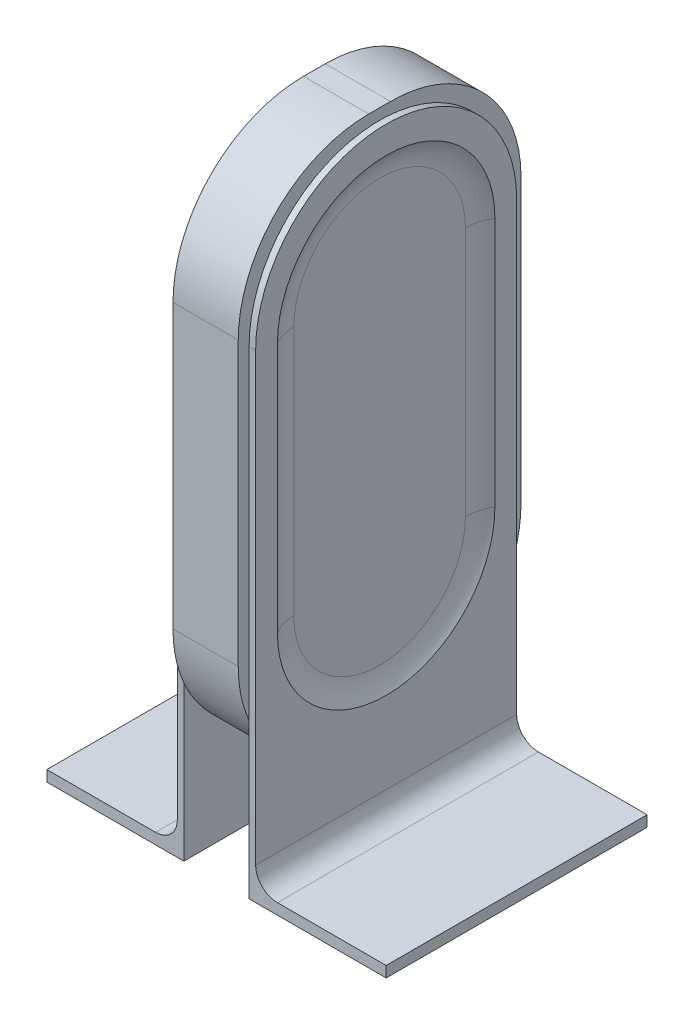
ISO-10303-21;
HEADER;
FILE_DESCRIPTION(('STEP AP214'),'2;1');
FILE_NAME('part.step','',(''),(''),'','','');
FILE_SCHEMA(('AUTOMOTIVE_DESIGN { 1 0 10303 214 1 1 1 1 }'));
ENDSEC;
DATA;
#1=APPLICATION_CONTEXT('core data for automotive mechanical design processes');
#2=APPLICATION_PROTOCOL_DEFINITION('international standard','automotive_design',2000,#1);
#3=PRODUCT_CONTEXT('',#1,'mechanical');
#4=PRODUCT('Part','Part','',(#3));
#5=PRODUCT_RELATED_PRODUCT_CATEGORY('part','',(#4));
#6=PRODUCT_DEFINITION_FORMATION('','',#4);
#7=PRODUCT_DEFINITION_CONTEXT('part definition',#1,'design');
#8=PRODUCT_DEFINITION('design','',#6,#7);
#9=PRODUCT_DEFINITION_SHAPE('','',#8);
#10=(LENGTH_UNIT() NAMED_UNIT(*) SI_UNIT(.MILLI.,.METRE.));
#11=(NAMED_UNIT(*) PLANE_ANGLE_UNIT() SI_UNIT($,.RADIAN.));
#12=(NAMED_UNIT(*) SI_UNIT($,.STERADIAN.) SOLID_ANGLE_UNIT());
#13=UNCERTAINTY_MEASURE_WITH_UNIT(LENGTH_MEASURE(1.E-05),#10,'distance_accuracy_value','');
#14=(GEOMETRIC_REPRESENTATION_CONTEXT(3) GLOBAL_UNCERTAINTY_ASSIGNED_CONTEXT((#13)) GLOBAL_UNIT_ASSIGNED_CONTEXT((#10,
#11,#12)) REPRESENTATION_CONTEXT('',''));
#15=CARTESIAN_POINT('',(0.,0.,0.));
#16=DIRECTION('',(0.,0.,1.));
#17=DIRECTION('',(1.,0.,0.));
#18=AXIS2_PLACEMENT_3D('',#15,#16,#17);
#19=CARTESIAN_POINT('',(18.,60.,0.));
#20=DIRECTION('',(1.,0.,0.));
#21=DIRECTION('',(0.,0.,-1.));
#22=AXIS2_PLACEMENT_3D('',#19,#20,#21);
#23=PLANE('',#22);
#24=DIRECTION('',(0.,1.,0.));
#25=VECTOR('',#24,1.);
#26=CARTESIAN_POINT('',(18.,-57.5,-50.));
#27=LINE('',#26,#25);
#28=CARTESIAN_POINT('',(18.,-57.5,-50.));
#29=VERTEX_POINT('',#28);
#30=CARTESIAN_POINT('',(18.,57.5,-50.));
#31=VERTEX_POINT('',#30);
#32=EDGE_CURVE('E383',#29,#31,#27,.T.);
#33=ORIENTED_EDGE('',*,*,#32,.F.);
#34=CARTESIAN_POINT('',(18.,-57.5,0.));
#35=DIRECTION('',(1.,0.,0.));
#36=DIRECTION('',(0.,0.,-1.));
#37=AXIS2_PLACEMENT_3D('',#34,#35,#36);
#38=CIRCLE('',#37,50.);
#39=CARTESIAN_POINT('',(18.,-57.5000000000001,50.));
#40=VERTEX_POINT('',#39);
#41=EDGE_CURVE('E379',#40,#29,#38,.T.);
#42=ORIENTED_EDGE('',*,*,#41,.F.);
#43=DIRECTION('',(0.,-1.,0.));
#44=VECTOR('',#43,1.);
#45=CARTESIAN_POINT('',(18.,-57.5000000000001,50.));
#46=LINE('',#45,#44);
#47=CARTESIAN_POINT('',(18.,57.5,50.));
#48=VERTEX_POINT('',#47);
#49=EDGE_CURVE('E392',#48,#40,#46,.T.);
#50=ORIENTED_EDGE('',*,*,#49,.F.);
#51=CARTESIAN_POINT('',(18.,57.5,0.));
#52=DIRECTION('',(1.,0.,0.));
#53=DIRECTION('',(0.,0.,-1.));
#54=AXIS2_PLACEMENT_3D('',#51,#52,#53);
#55=CIRCLE('',#54,50.);
#56=EDGE_CURVE('E388',#31,#48,#55,.T.);
#57=ORIENTED_EDGE('',*,*,#56,.F.);
#58=EDGE_LOOP('',(#33,#42,#50,#57));
#59=FACE_BOUND('',#58,.T.);
#60=DIRECTION('',(0.,-1.,0.));
#61=VECTOR('',#60,1.);
#62=CARTESIAN_POINT('',(18.,-60.,60.));
#63=LINE('',#62,#61);
#64=CARTESIAN_POINT('',(18.,60.,60.));
#65=VERTEX_POINT('',#64);
#66=CARTESIAN_POINT('',(18.,-145.,60.));
#67=VERTEX_POINT('',#66);
#68=EDGE_CURVE('E397',#65,#67,#63,.T.);
#69=ORIENTED_EDGE('',*,*,#68,.T.);
#70=DIRECTION('',(0.,0.,-1.));
#71=VECTOR('',#70,1.);
#72=CARTESIAN_POINT('',(18.,-145.,0.));
#73=LINE('',#72,#71);
#74=CARTESIAN_POINT('',(18.,-145.,-60.0000000000001));
#75=VERTEX_POINT('',#74);
#76=EDGE_CURVE('E571',#67,#75,#73,.T.);
#77=ORIENTED_EDGE('',*,*,#76,.T.);
#78=DIRECTION('',(0.,1.,0.));
#79=VECTOR('',#78,1.);
#80=CARTESIAN_POINT('',(18.,-160.,-60.0000000000001));
#81=LINE('',#80,#79);
#82=CARTESIAN_POINT('',(18.,60.,-60.));
#83=VERTEX_POINT('',#82);
#84=EDGE_CURVE('E401',#75,#83,#81,.T.);
#85=ORIENTED_EDGE('',*,*,#84,.T.);
#86=CARTESIAN_POINT('',(18.,60.,0.));
#87=DIRECTION('',(1.,0.,0.));
#88=DIRECTION('',(0.,0.,-1.));
#89=AXIS2_PLACEMENT_3D('',#86,#87,#88);
#90=CIRCLE('',#89,60.);
#91=EDGE_CURVE('E405',#83,#65,#90,.T.);
#92=ORIENTED_EDGE('',*,*,#91,.T.);
#93=EDGE_LOOP('',(#69,#77,#85,#92));
#94=FACE_BOUND('',#93,.T.);
#95=ADVANCED_FACE('F45',(#59,#94),#23,.T.);
#96=CARTESIAN_POINT('',(15.,65.,5.00000000000002));
#97=DIRECTION('',(-1.,0.,0.));
#98=DIRECTION('',(0.,0.,1.));
#99=AXIS2_PLACEMENT_3D('',#96,#97,#98);
#100=CYLINDRICAL_SURFACE('',#99,60.);
#101=CARTESIAN_POINT('',(-15.,65.,5.00000000000002));
#102=DIRECTION('',(1.,0.,0.));
#103=DIRECTION('',(0.,0.,-1.));
#104=AXIS2_PLACEMENT_3D('',#101,#102,#103);
#105=CIRCLE('',#104,60.);
#106=CARTESIAN_POINT('',(-15.,125.,5.00000000000002));
#107=VERTEX_POINT('',#106);
#108=CARTESIAN_POINT('',(-15.,65.,65.));
#109=VERTEX_POINT('',#108);
#110=EDGE_CURVE('E441',#107,#109,#105,.T.);
#111=ORIENTED_EDGE('',*,*,#110,.T.);
#112=DIRECTION('',(-1.,0.,0.));
#113=VECTOR('',#112,1.);
#114=CARTESIAN_POINT('',(15.,65.,65.));
#115=LINE('',#114,#113);
#116=CARTESIAN_POINT('',(15.,65.,65.));
#117=VERTEX_POINT('',#116);
#118=EDGE_CURVE('E529',#117,#109,#115,.T.);
#119=ORIENTED_EDGE('',*,*,#118,.F.);
#120=CARTESIAN_POINT('',(15.,65.,5.00000000000002));
#121=DIRECTION('',(1.,0.,0.));
#122=DIRECTION('',(0.,0.,-1.));
#123=AXIS2_PLACEMENT_3D('',#120,#121,#122);
#124=CIRCLE('',#123,60.);
#125=CARTESIAN_POINT('',(15.,125.,5.00000000000002));
#126=VERTEX_POINT('',#125);
#127=EDGE_CURVE('E442',#126,#117,#124,.T.);
#128=ORIENTED_EDGE('',*,*,#127,.F.);
#129=DIRECTION('',(-1.,0.,0.));
#130=VECTOR('',#129,1.);
#131=CARTESIAN_POINT('',(15.,125.,5.00000000000002));
#132=LINE('',#131,#130);
#133=EDGE_CURVE('E473',#126,#107,#132,.T.);
#134=ORIENTED_EDGE('',*,*,#133,.T.);
#135=EDGE_LOOP('',(#111,#119,#128,#134));
#136=FACE_BOUND('',#135,.T.);
#137=ADVANCED_FACE('F652',(#136),#100,.T.);
#138=CARTESIAN_POINT('',(15.,65.,65.));
#139=DIRECTION('',(0.,0.,-1.));
#140=DIRECTION('',(-1.,0.,0.));
#141=AXIS2_PLACEMENT_3D('',#138,#139,#140);
#142=PLANE('',#141);
#143=DIRECTION('',(0.,-1.,0.));
#144=VECTOR('',#143,1.);
#145=CARTESIAN_POINT('',(-15.,65.,65.));
#146=LINE('',#145,#144);
#147=CARTESIAN_POINT('',(-15.,-65.,65.));
#148=VERTEX_POINT('',#147);
#149=EDGE_CURVE('E477',#109,#148,#146,.T.);
#150=ORIENTED_EDGE('',*,*,#149,.T.);
#151=DIRECTION('',(-1.,0.,0.));
#152=VECTOR('',#151,1.);
#153=CARTESIAN_POINT('',(15.,-65.,65.));
#154=LINE('',#153,#152);
#155=CARTESIAN_POINT('',(15.,-65.,65.));
#156=VERTEX_POINT('',#155);
#157=EDGE_CURVE('E525',#156,#148,#154,.T.);
#158=ORIENTED_EDGE('',*,*,#157,.F.);
#159=DIRECTION('',(0.,-1.,0.));
#160=VECTOR('',#159,1.);
#161=CARTESIAN_POINT('',(15.,65.,65.));
#162=LINE('',#161,#160);
#163=EDGE_CURVE('E446',#117,#156,#162,.T.);
#164=ORIENTED_EDGE('',*,*,#163,.F.);
#165=ORIENTED_EDGE('',*,*,#118,.T.);
#166=EDGE_LOOP('',(#150,#158,#164,#165));
#167=FACE_BOUND('',#166,.T.);
#168=ADVANCED_FACE('F647',(#167),#142,.F.);
#169=CARTESIAN_POINT('',(15.,-65.,5.));
#170=DIRECTION('',(-1.,0.,0.));
#171=DIRECTION('',(0.,0.,1.));
#172=AXIS2_PLACEMENT_3D('',#169,#170,#171);
#173=CYLINDRICAL_SURFACE('',#172,60.);
#174=CARTESIAN_POINT('',(-15.,-65.,5.));
#175=DIRECTION('',(1.,0.,0.));
#176=DIRECTION('',(0.,0.,1.));
#177=AXIS2_PLACEMENT_3D('',#174,#175,#176);
#178=CIRCLE('',#177,60.);
#179=CARTESIAN_POINT('',(-15.,-88.9791576165636,60.));
#180=VERTEX_POINT('',#179);
#181=EDGE_CURVE('E481',#148,#180,#178,.T.);
#182=ORIENTED_EDGE('',*,*,#181,.T.);
#183=CARTESIAN_POINT('',(-15.,-125.,5.));
#184=VERTEX_POINT('',#183);
#185=EDGE_CURVE('E480',#180,#184,#178,.T.);
#186=ORIENTED_EDGE('',*,*,#185,.T.);
#187=DIRECTION('',(-1.,0.,0.));
#188=VECTOR('',#187,1.);
#189=CARTESIAN_POINT('',(15.,-125.,5.));
#190=LINE('',#189,#188);
#191=CARTESIAN_POINT('',(15.,-125.,5.));
#192=VERTEX_POINT('',#191);
#193=EDGE_CURVE('E521',#192,#184,#190,.T.);
#194=ORIENTED_EDGE('',*,*,#193,.F.);
#195=CARTESIAN_POINT('',(15.,-65.,5.));
#196=DIRECTION('',(1.,0.,0.));
#197=DIRECTION('',(0.,0.,1.));
#198=AXIS2_PLACEMENT_3D('',#195,#196,#197);
#199=CIRCLE('',#198,60.);
#200=CARTESIAN_POINT('',(15.,-88.9791576165635,60.));
#201=VERTEX_POINT('',#200);
#202=EDGE_CURVE('E450',#201,#192,#199,.T.);
#203=ORIENTED_EDGE('',*,*,#202,.F.);
#204=EDGE_CURVE('E451',#156,#201,#199,.T.);
#205=ORIENTED_EDGE('',*,*,#204,.F.);
#206=ORIENTED_EDGE('',*,*,#157,.T.);
#207=EDGE_LOOP('',(#182,#186,#194,#203,#205,#206));
#208=FACE_BOUND('',#207,.T.);
#209=ADVANCED_FACE('F640',(#208),#173,.T.);
#210=CARTESIAN_POINT('',(15.,-125.,-5.00000000000001));
#211=DIRECTION('',(0.,1.,0.));
#212=DIRECTION('',(0.,0.,1.));
#213=AXIS2_PLACEMENT_3D('',#210,#211,#212);
#214=PLANE('',#213);
#215=DIRECTION('',(0.,0.,-1.));
#216=VECTOR('',#215,1.);
#217=CARTESIAN_POINT('',(-15.,-125.,-5.00000000000001));
#218=LINE('',#217,#216);
#219=CARTESIAN_POINT('',(-15.,-125.,-5.00000000000002));
#220=VERTEX_POINT('',#219);
#221=EDGE_CURVE('E485',#184,#220,#218,.T.);
#222=ORIENTED_EDGE('',*,*,#221,.T.);
#223=DIRECTION('',(-1.,0.,0.));
#224=VECTOR('',#223,1.);
#225=CARTESIAN_POINT('',(15.,-125.,-5.00000000000002));
#226=LINE('',#225,#224);
#227=CARTESIAN_POINT('',(15.,-125.,-5.00000000000002));
#228=VERTEX_POINT('',#227);
#229=EDGE_CURVE('E517',#228,#220,#226,.T.);
#230=ORIENTED_EDGE('',*,*,#229,.F.);
#231=DIRECTION('',(0.,0.,-1.));
#232=VECTOR('',#231,1.);
#233=CARTESIAN_POINT('',(15.,-125.,-5.00000000000001));
#234=LINE('',#233,#232);
#235=EDGE_CURVE('E455',#192,#228,#234,.T.);
#236=ORIENTED_EDGE('',*,*,#235,.F.);
#237=ORIENTED_EDGE('',*,*,#193,.T.);
#238=EDGE_LOOP('',(#222,#230,#236,#237));
#239=FACE_BOUND('',#238,.T.);
#240=ADVANCED_FACE('F628',(#239),#214,.F.);
#241=CARTESIAN_POINT('',(15.,-65.,-5.00000000000001));
#242=DIRECTION('',(-1.,0.,0.));
#243=DIRECTION('',(0.,0.,1.));
#244=AXIS2_PLACEMENT_3D('',#241,#242,#243);
#245=CYLINDRICAL_SURFACE('',#244,60.);
#246=CARTESIAN_POINT('',(-15.,-65.,-5.00000000000001));
#247=DIRECTION('',(1.,0.,0.));
#248=DIRECTION('',(0.,0.,1.));
#249=AXIS2_PLACEMENT_3D('',#246,#247,#248);
#250=CIRCLE('',#249,60.);
#251=CARTESIAN_POINT('',(-15.,-88.9791576165637,-60.));
#252=VERTEX_POINT('',#251);
#253=EDGE_CURVE('E490',#220,#252,#250,.T.);
#254=ORIENTED_EDGE('',*,*,#253,.T.);
#255=CARTESIAN_POINT('',(-15.,-65.,-65.));
#256=VERTEX_POINT('',#255);
#257=EDGE_CURVE('E489',#252,#256,#250,.T.);
#258=ORIENTED_EDGE('',*,*,#257,.T.);
#259=DIRECTION('',(-1.,0.,0.));
#260=VECTOR('',#259,1.);
#261=CARTESIAN_POINT('',(15.,-65.,-65.));
#262=LINE('',#261,#260);
#263=CARTESIAN_POINT('',(15.,-65.,-65.));
#264=VERTEX_POINT('',#263);
#265=EDGE_CURVE('E513',#264,#256,#262,.T.);
#266=ORIENTED_EDGE('',*,*,#265,.F.);
#267=CARTESIAN_POINT('',(15.,-65.,-5.00000000000001));
#268=DIRECTION('',(1.,0.,0.));
#269=DIRECTION('',(0.,0.,1.));
#270=AXIS2_PLACEMENT_3D('',#267,#268,#269);
#271=CIRCLE('',#270,60.);
#272=CARTESIAN_POINT('',(15.,-88.9791576165637,-60.));
#273=VERTEX_POINT('',#272);
#274=EDGE_CURVE('E459',#273,#264,#271,.T.);
#275=ORIENTED_EDGE('',*,*,#274,.F.);
#276=EDGE_CURVE('E460',#228,#273,#271,.T.);
#277=ORIENTED_EDGE('',*,*,#276,.F.);
#278=ORIENTED_EDGE('',*,*,#229,.T.);
#279=EDGE_LOOP('',(#254,#258,#266,#275,#277,#278));
#280=FACE_BOUND('',#279,.T.);
#281=ADVANCED_FACE('F631',(#280),#245,.T.);
#282=CARTESIAN_POINT('',(15.,65.,-65.));
#283=DIRECTION('',(0.,0.,1.));
#284=DIRECTION('',(0.,-1.,0.));
#285=AXIS2_PLACEMENT_3D('',#282,#283,#284);
#286=PLANE('',#285);
#287=DIRECTION('',(0.,1.,0.));
#288=VECTOR('',#287,1.);
#289=CARTESIAN_POINT('',(-15.,65.,-65.));
#290=LINE('',#289,#288);
#291=CARTESIAN_POINT('',(-15.,65.,-65.));
#292=VERTEX_POINT('',#291);
#293=EDGE_CURVE('E494',#256,#292,#290,.T.);
#294=ORIENTED_EDGE('',*,*,#293,.T.);
#295=DIRECTION('',(-1.,0.,0.));
#296=VECTOR('',#295,1.);
#297=CARTESIAN_POINT('',(15.,65.,-65.));
#298=LINE('',#297,#296);
#299=CARTESIAN_POINT('',(15.,65.,-65.));
#300=VERTEX_POINT('',#299);
#301=EDGE_CURVE('E509',#300,#292,#298,.T.);
#302=ORIENTED_EDGE('',*,*,#301,.F.);
#303=DIRECTION('',(0.,1.,0.));
#304=VECTOR('',#303,1.);
#305=CARTESIAN_POINT('',(15.,65.,-65.));
#306=LINE('',#305,#304);
#307=EDGE_CURVE('E464',#264,#300,#306,.T.);
#308=ORIENTED_EDGE('',*,*,#307,.F.);
#309=ORIENTED_EDGE('',*,*,#265,.T.);
#310=EDGE_LOOP('',(#294,#302,#308,#309));
#311=FACE_BOUND('',#310,.T.);
#312=ADVANCED_FACE('F665',(#311),#286,.F.);
#313=CARTESIAN_POINT('',(15.,65.,-4.99999999999999));
#314=DIRECTION('',(-1.,0.,0.));
#315=DIRECTION('',(0.,0.,1.));
#316=AXIS2_PLACEMENT_3D('',#313,#314,#315);
#317=CYLINDRICAL_SURFACE('',#316,60.);
#318=CARTESIAN_POINT('',(-15.,65.,-4.99999999999999));
#319=DIRECTION('',(1.,0.,0.));
#320=DIRECTION('',(0.,0.,1.));
#321=AXIS2_PLACEMENT_3D('',#318,#319,#320);
#322=CIRCLE('',#321,60.);
#323=CARTESIAN_POINT('',(-15.,125.,-4.99999999999998));
#324=VERTEX_POINT('',#323);
#325=EDGE_CURVE('E497',#292,#324,#322,.T.);
#326=ORIENTED_EDGE('',*,*,#325,.T.);
#327=DIRECTION('',(-1.,0.,0.));
#328=VECTOR('',#327,1.);
#329=CARTESIAN_POINT('',(15.,125.,-4.99999999999998));
#330=LINE('',#329,#328);
#331=CARTESIAN_POINT('',(15.,125.,-4.99999999999998));
#332=VERTEX_POINT('',#331);
#333=EDGE_CURVE('E505',#332,#324,#330,.T.);
#334=ORIENTED_EDGE('',*,*,#333,.F.);
#335=CARTESIAN_POINT('',(15.,65.,-4.99999999999999));
#336=DIRECTION('',(1.,0.,0.));
#337=DIRECTION('',(0.,0.,1.));
#338=AXIS2_PLACEMENT_3D('',#335,#336,#337);
#339=CIRCLE('',#338,60.);
#340=EDGE_CURVE('E467',#300,#332,#339,.T.);
#341=ORIENTED_EDGE('',*,*,#340,.F.);
#342=ORIENTED_EDGE('',*,*,#301,.T.);
#343=EDGE_LOOP('',(#326,#334,#341,#342));
#344=FACE_BOUND('',#343,.T.);
#345=ADVANCED_FACE('F660',(#344),#317,.T.);
#346=CARTESIAN_POINT('',(15.,125.,-4.99999999999998));
#347=DIRECTION('',(0.,-1.,0.));
#348=DIRECTION('',(0.,0.,-1.));
#349=AXIS2_PLACEMENT_3D('',#346,#347,#348);
#350=PLANE('',#349);
#351=DIRECTION('',(0.,0.,1.));
#352=VECTOR('',#351,1.);
#353=CARTESIAN_POINT('',(-15.,125.,-4.99999999999998));
#354=LINE('',#353,#352);
#355=EDGE_CURVE('E447',#324,#107,#354,.T.);
#356=ORIENTED_EDGE('',*,*,#355,.T.);
#357=ORIENTED_EDGE('',*,*,#133,.F.);
#358=DIRECTION('',(0.,0.,1.));
#359=VECTOR('',#358,1.);
#360=CARTESIAN_POINT('',(15.,125.,-4.99999999999998));
#361=LINE('',#360,#359);
#362=EDGE_CURVE('E470',#332,#126,#361,.T.);
#363=ORIENTED_EDGE('',*,*,#362,.F.);
#364=ORIENTED_EDGE('',*,*,#333,.T.);
#365=EDGE_LOOP('',(#356,#357,#363,#364));
#366=FACE_BOUND('',#365,.T.);
#367=ADVANCED_FACE('F656',(#366),#350,.F.);
#368=CARTESIAN_POINT('',(15.,65.,5.00000000000002));
#369=DIRECTION('',(1.,0.,0.));
#370=DIRECTION('',(0.,0.,-1.));
#371=AXIS2_PLACEMENT_3D('',#368,#369,#370);
#372=PLANE('',#371);
#373=DIRECTION('',(0.,-1.,0.));
#374=VECTOR('',#373,1.);
#375=CARTESIAN_POINT('',(15.,-60.,60.));
#376=LINE('',#375,#374);
#377=CARTESIAN_POINT('',(15.,60.,60.));
#378=VERTEX_POINT('',#377);
#379=EDGE_CURVE('E402',#378,#201,#376,.T.);
#380=ORIENTED_EDGE('',*,*,#379,.F.);
#381=CARTESIAN_POINT('',(15.,60.,0.));
#382=DIRECTION('',(1.,0.,0.));
#383=DIRECTION('',(0.,0.,-1.));
#384=AXIS2_PLACEMENT_3D('',#381,#382,#383);
#385=CIRCLE('',#384,60.);
#386=CARTESIAN_POINT('',(15.,60.,-60.));
#387=VERTEX_POINT('',#386);
#388=EDGE_CURVE('E417',#387,#378,#385,.T.);
#389=ORIENTED_EDGE('',*,*,#388,.F.);
#390=DIRECTION('',(0.,1.,0.));
#391=VECTOR('',#390,1.);
#392=CARTESIAN_POINT('',(15.,-60.,-60.));
#393=LINE('',#392,#391);
#394=EDGE_CURVE('E418',#273,#387,#393,.T.);
#395=ORIENTED_EDGE('',*,*,#394,.F.);
#396=ORIENTED_EDGE('',*,*,#274,.T.);
#397=ORIENTED_EDGE('',*,*,#307,.T.);
#398=ORIENTED_EDGE('',*,*,#340,.T.);
#399=ORIENTED_EDGE('',*,*,#362,.T.);
#400=ORIENTED_EDGE('',*,*,#127,.T.);
#401=ORIENTED_EDGE('',*,*,#163,.T.);
#402=ORIENTED_EDGE('',*,*,#204,.T.);
#403=EDGE_LOOP('',(#380,#389,#395,#396,#397,#398,#399,#400,#401,#402));
#404=FACE_BOUND('',#403,.T.);
#405=ADVANCED_FACE('F642',(#404),#372,.T.);
#406=CARTESIAN_POINT('',(-15.,65.,5.00000000000002));
#407=DIRECTION('',(1.,0.,0.));
#408=DIRECTION('',(0.,0.,-1.));
#409=AXIS2_PLACEMENT_3D('',#406,#407,#408);
#410=PLANE('',#409);
#411=ORIENTED_EDGE('',*,*,#257,.F.);
#412=DIRECTION('',(0.,1.,0.));
#413=VECTOR('',#412,1.);
#414=CARTESIAN_POINT('',(-15.,65.0000000000001,-59.9999999999998));
#415=LINE('',#414,#413);
#416=CARTESIAN_POINT('',(-15.,60.,-60.));
#417=VERTEX_POINT('',#416);
#418=EDGE_CURVE('E346',#252,#417,#415,.T.);
#419=ORIENTED_EDGE('',*,*,#418,.T.);
#420=CARTESIAN_POINT('',(-15.,60.,0.));
#421=DIRECTION('',(1.,0.,0.));
#422=DIRECTION('',(0.,0.,-1.));
#423=AXIS2_PLACEMENT_3D('',#420,#421,#422);
#424=CIRCLE('',#423,60.);
#425=CARTESIAN_POINT('',(-15.,60.,60.));
#426=VERTEX_POINT('',#425);
#427=EDGE_CURVE('E321',#417,#426,#424,.T.);
#428=ORIENTED_EDGE('',*,*,#427,.T.);
#429=DIRECTION('',(0.,-1.,0.));
#430=VECTOR('',#429,1.);
#431=CARTESIAN_POINT('',(-15.,65.,60.0000000000001));
#432=LINE('',#431,#430);
#433=EDGE_CURVE('E338',#426,#180,#432,.T.);
#434=ORIENTED_EDGE('',*,*,#433,.T.);
#435=ORIENTED_EDGE('',*,*,#181,.F.);
#436=ORIENTED_EDGE('',*,*,#149,.F.);
#437=ORIENTED_EDGE('',*,*,#110,.F.);
#438=ORIENTED_EDGE('',*,*,#355,.F.);
#439=ORIENTED_EDGE('',*,*,#325,.F.);
#440=ORIENTED_EDGE('',*,*,#293,.F.);
#441=EDGE_LOOP('',(#411,#419,#428,#434,#435,#436,#437,#438,#439,#440));
#442=FACE_BOUND('',#441,.T.);
#443=ADVANCED_FACE('F624',(#442),#410,.F.);
#444=CARTESIAN_POINT('',(15.,60.,0.));
#445=DIRECTION('',(1.,0.,0.));
#446=DIRECTION('',(0.,0.,-1.));
#447=AXIS2_PLACEMENT_3D('',#444,#445,#446);
#448=PLANE('',#447);
#449=CARTESIAN_POINT('',(15.,-160.,60.));
#450=VERTEX_POINT('',#449);
#451=EDGE_CURVE('E422',#201,#450,#376,.T.);
#452=ORIENTED_EDGE('',*,*,#451,.F.);
#453=ORIENTED_EDGE('',*,*,#202,.T.);
#454=ORIENTED_EDGE('',*,*,#235,.T.);
#455=ORIENTED_EDGE('',*,*,#276,.T.);
#456=CARTESIAN_POINT('',(15.,-160.,-60.0000000000001));
#457=VERTEX_POINT('',#456);
#458=EDGE_CURVE('E413',#457,#273,#393,.T.);
#459=ORIENTED_EDGE('',*,*,#458,.F.);
#460=DIRECTION('',(0.,0.,-1.));
#461=VECTOR('',#460,1.);
#462=CARTESIAN_POINT('',(15.,-160.,60.));
#463=LINE('',#462,#461);
#464=EDGE_CURVE('E396',#450,#457,#463,.T.);
#465=ORIENTED_EDGE('',*,*,#464,.F.);
#466=EDGE_LOOP('',(#452,#453,#454,#455,#459,#465));
#467=FACE_BOUND('',#466,.T.);
#468=ADVANCED_FACE('F636',(#467),#448,.F.);
#469=CARTESIAN_POINT('',(18.,-160.,60.));
#470=DIRECTION('',(0.,1.,0.));
#471=DIRECTION('',(0.,0.,1.));
#472=AXIS2_PLACEMENT_3D('',#469,#470,#471);
#473=PLANE('',#472);
#474=ORIENTED_EDGE('',*,*,#464,.T.);
#475=DIRECTION('',(-1.,0.,0.));
#476=VECTOR('',#475,1.);
#477=CARTESIAN_POINT('',(18.,-160.,-60.0000000000001));
#478=LINE('',#477,#476);
#479=CARTESIAN_POINT('',(78.,-160.,-60.0000000000001));
#480=VERTEX_POINT('',#479);
#481=EDGE_CURVE('E433',#480,#457,#478,.T.);
#482=ORIENTED_EDGE('',*,*,#481,.F.);
#483=DIRECTION('',(0.,0.,1.));
#484=VECTOR('',#483,1.);
#485=CARTESIAN_POINT('',(78.,-160.,60.));
#486=LINE('',#485,#484);
#487=CARTESIAN_POINT('',(78.,-160.,60.));
#488=VERTEX_POINT('',#487);
#489=EDGE_CURVE('E264',#480,#488,#486,.T.);
#490=ORIENTED_EDGE('',*,*,#489,.T.);
#491=DIRECTION('',(-1.,0.,0.));
#492=VECTOR('',#491,1.);
#493=CARTESIAN_POINT('',(18.,-160.,60.));
#494=LINE('',#493,#492);
#495=EDGE_CURVE('E437',#488,#450,#494,.T.);
#496=ORIENTED_EDGE('',*,*,#495,.T.);
#497=EDGE_LOOP('',(#474,#482,#490,#496));
#498=FACE_BOUND('',#497,.T.);
#499=ADVANCED_FACE('F688',(#498),#473,.F.);
#500=CARTESIAN_POINT('',(18.,-60.,-60.));
#501=DIRECTION('',(0.,0.,1.));
#502=DIRECTION('',(0.,-1.,0.));
#503=AXIS2_PLACEMENT_3D('',#500,#501,#502);
#504=PLANE('',#503);
#505=ORIENTED_EDGE('',*,*,#458,.T.);
#506=ORIENTED_EDGE('',*,*,#394,.T.);
#507=DIRECTION('',(-1.,0.,0.));
#508=VECTOR('',#507,1.);
#509=CARTESIAN_POINT('',(18.,60.,-60.));
#510=LINE('',#509,#508);
#511=EDGE_CURVE('E429',#83,#387,#510,.T.);
#512=ORIENTED_EDGE('',*,*,#511,.F.);
#513=ORIENTED_EDGE('',*,*,#84,.F.);
#514=CARTESIAN_POINT('',(28.,-145.,-60.));
#515=DIRECTION('',(0.,0.,1.));
#516=DIRECTION('',(0.,-1.,0.));
#517=AXIS2_PLACEMENT_3D('',#514,#515,#516);
#518=CIRCLE('',#517,10.);
#519=CARTESIAN_POINT('',(28.,-155.,-60.0000000000001));
#520=VERTEX_POINT('',#519);
#521=EDGE_CURVE('E54',#75,#520,#518,.T.);
#522=ORIENTED_EDGE('',*,*,#521,.T.);
#523=DIRECTION('',(1.,0.,0.));
#524=VECTOR('',#523,1.);
#525=CARTESIAN_POINT('',(18.,-155.,-60.0000000000001));
#526=LINE('',#525,#524);
#527=CARTESIAN_POINT('',(78.,-155.,-60.0000000000001));
#528=VERTEX_POINT('',#527);
#529=EDGE_CURVE('E356',#520,#528,#526,.T.);
#530=ORIENTED_EDGE('',*,*,#529,.T.);
#531=DIRECTION('',(0.,-1.,0.));
#532=VECTOR('',#531,1.);
#533=CARTESIAN_POINT('',(78.,-155.,-60.0000000000001));
#534=LINE('',#533,#532);
#535=EDGE_CURVE('E367',#528,#480,#534,.T.);
#536=ORIENTED_EDGE('',*,*,#535,.T.);
#537=ORIENTED_EDGE('',*,*,#481,.T.);
#538=EDGE_LOOP('',(#505,#506,#512,#513,#522,#530,#536,#537));
#539=FACE_BOUND('',#538,.T.);
#540=ADVANCED_FACE('F667',(#539),#504,.F.);
#541=CARTESIAN_POINT('',(18.,60.,0.));
#542=DIRECTION('',(-1.,0.,0.));
#543=DIRECTION('',(0.,0.,1.));
#544=AXIS2_PLACEMENT_3D('',#541,#542,#543);
#545=CYLINDRICAL_SURFACE('',#544,60.);
#546=ORIENTED_EDGE('',*,*,#388,.T.);
#547=DIRECTION('',(-1.,0.,0.));
#548=VECTOR('',#547,1.);
#549=CARTESIAN_POINT('',(18.,60.,60.));
#550=LINE('',#549,#548);
#551=EDGE_CURVE('E409',#65,#378,#550,.T.);
#552=ORIENTED_EDGE('',*,*,#551,.F.);
#553=ORIENTED_EDGE('',*,*,#91,.F.);
#554=ORIENTED_EDGE('',*,*,#511,.T.);
#555=EDGE_LOOP('',(#546,#552,#553,#554));
#556=FACE_BOUND('',#555,.T.);
#557=ADVANCED_FACE('F670',(#556),#545,.T.);
#558=CARTESIAN_POINT('',(18.,-60.,60.));
#559=DIRECTION('',(0.,0.,-1.));
#560=DIRECTION('',(0.,1.,0.));
#561=AXIS2_PLACEMENT_3D('',#558,#559,#560);
#562=PLANE('',#561);
#563=ORIENTED_EDGE('',*,*,#379,.T.);
#564=ORIENTED_EDGE('',*,*,#451,.T.);
#565=ORIENTED_EDGE('',*,*,#495,.F.);
#566=DIRECTION('',(0.,-1.,0.));
#567=VECTOR('',#566,1.);
#568=CARTESIAN_POINT('',(78.,-155.,60.));
#569=LINE('',#568,#567);
#570=CARTESIAN_POINT('',(78.,-155.,60.));
#571=VERTEX_POINT('',#570);
#572=EDGE_CURVE('E371',#571,#488,#569,.T.);
#573=ORIENTED_EDGE('',*,*,#572,.F.);
#574=DIRECTION('',(-1.,0.,0.));
#575=VECTOR('',#574,1.);
#576=CARTESIAN_POINT('',(18.,-155.,60.));
#577=LINE('',#576,#575);
#578=CARTESIAN_POINT('',(28.,-155.,60.));
#579=VERTEX_POINT('',#578);
#580=EDGE_CURVE('E363',#571,#579,#577,.T.);
#581=ORIENTED_EDGE('',*,*,#580,.T.);
#582=CARTESIAN_POINT('',(28.,-145.,60.));
#583=DIRECTION('',(0.,0.,-1.));
#584=DIRECTION('',(0.,1.,0.));
#585=AXIS2_PLACEMENT_3D('',#582,#583,#584);
#586=CIRCLE('',#585,10.);
#587=EDGE_CURVE('E11',#579,#67,#586,.T.);
#588=ORIENTED_EDGE('',*,*,#587,.T.);
#589=ORIENTED_EDGE('',*,*,#68,.F.);
#590=ORIENTED_EDGE('',*,*,#551,.T.);
#591=EDGE_LOOP('',(#563,#564,#565,#573,#581,#588,#589,#590));
#592=FACE_BOUND('',#591,.T.);
#593=ADVANCED_FACE('F682',(#592),#562,.F.);
#594=CARTESIAN_POINT('',(15.,-57.5,0.));
#595=DIRECTION('',(1.,0.,0.));
#596=DIRECTION('',(0.,0.,-1.));
#597=AXIS2_PLACEMENT_3D('',#594,#595,#596);
#598=CIRCLE('',#597,39.4643462471473);
#599=CARTESIAN_POINT('',(15.,-57.5000000000001,39.4643462471472));
#600=VERTEX_POINT('',#599);
#601=CARTESIAN_POINT('',(15.,-57.5,-39.4643462471473));
#602=VERTEX_POINT('',#601);
#603=EDGE_CURVE('E539',#600,#602,#598,.T.);
#604=ORIENTED_EDGE('',*,*,#603,.T.);
#605=DIRECTION('',(0.,-1.,0.));
#606=VECTOR('',#605,1.);
#607=CARTESIAN_POINT('',(15.,57.5,-39.4643462471473));
#608=LINE('',#607,#606);
#609=CARTESIAN_POINT('',(15.,57.5,-39.4643462471473));
#610=VERTEX_POINT('',#609);
#611=EDGE_CURVE('E542',#602,#610,#608,.F.);
#612=ORIENTED_EDGE('',*,*,#611,.T.);
#613=CARTESIAN_POINT('',(15.,57.5,0.));
#614=DIRECTION('',(1.,0.,0.));
#615=DIRECTION('',(0.,0.,-1.));
#616=AXIS2_PLACEMENT_3D('',#613,#614,#615);
#617=CIRCLE('',#616,39.4643462471473);
#618=CARTESIAN_POINT('',(15.,57.5,39.4643462471473));
#619=VERTEX_POINT('',#618);
#620=EDGE_CURVE('E533',#610,#619,#617,.T.);
#621=ORIENTED_EDGE('',*,*,#620,.T.);
#622=DIRECTION('',(0.,1.,0.));
#623=VECTOR('',#622,1.);
#624=CARTESIAN_POINT('',(15.,-57.5,39.4643462471472));
#625=LINE('',#624,#623);
#626=EDGE_CURVE('E536',#619,#600,#625,.F.);
#627=ORIENTED_EDGE('',*,*,#626,.T.);
#628=EDGE_LOOP('',(#604,#612,#621,#627));
#629=FACE_BOUND('',#628,.T.);
#630=ADVANCED_FACE('F711',(#629),#372,.T.);
#631=CARTESIAN_POINT('',(35.,-57.5000000000001,39.4643462471472));
#632=DIRECTION('',(0.,-1.,0.));
#633=DIRECTION('',(0.,0.,-1.));
#634=AXIS2_PLACEMENT_3D('',#631,#632,#633);
#635=CYLINDRICAL_SURFACE('',#634,20.);
#636=CARTESIAN_POINT('',(35.,57.5,39.4643462471473));
#637=DIRECTION('',(0.,-1.,0.));
#638=DIRECTION('',(0.,0.,-1.));
#639=AXIS2_PLACEMENT_3D('',#636,#637,#638);
#640=CIRCLE('',#639,20.);
#641=EDGE_CURVE('E551',#48,#619,#640,.T.);
#642=ORIENTED_EDGE('',*,*,#641,.F.);
#643=ORIENTED_EDGE('',*,*,#49,.T.);
#644=CARTESIAN_POINT('',(35.,-57.5000000000001,39.4643462471472));
#645=DIRECTION('',(0.,1.,0.));
#646=DIRECTION('',(0.,0.,1.));
#647=AXIS2_PLACEMENT_3D('',#644,#645,#646);
#648=CIRCLE('',#647,20.);
#649=EDGE_CURVE('E384',#600,#40,#648,.T.);
#650=ORIENTED_EDGE('',*,*,#649,.F.);
#651=ORIENTED_EDGE('',*,*,#626,.F.);
#652=EDGE_LOOP('',(#642,#643,#650,#651));
#653=FACE_BOUND('',#652,.T.);
#654=ADVANCED_FACE('F730',(#653),#635,.F.);
#655=CARTESIAN_POINT('',(35.,-57.5,0.));
#656=DIRECTION('',(-1.,0.,0.));
#657=DIRECTION('',(0.,0.,1.));
#658=AXIS2_PLACEMENT_3D('',#655,#656,#657);
#659=TOROIDAL_SURFACE('',#658,39.4643462471473,20.);
#660=ORIENTED_EDGE('',*,*,#649,.T.);
#661=ORIENTED_EDGE('',*,*,#41,.T.);
#662=CARTESIAN_POINT('',(35.,-57.5,-39.4643462471473));
#663=DIRECTION('',(0.,-1.,0.));
#664=DIRECTION('',(0.,0.,-1.));
#665=AXIS2_PLACEMENT_3D('',#662,#663,#664);
#666=CIRCLE('',#665,20.);
#667=EDGE_CURVE('E548',#602,#29,#666,.T.);
#668=ORIENTED_EDGE('',*,*,#667,.F.);
#669=ORIENTED_EDGE('',*,*,#603,.F.);
#670=EDGE_LOOP('',(#660,#661,#668,#669));
#671=FACE_BOUND('',#670,.T.);
#672=ADVANCED_FACE('F738',(#671),#659,.F.);
#673=CARTESIAN_POINT('',(35.,57.5,0.));
#674=DIRECTION('',(-1.,0.,0.));
#675=DIRECTION('',(0.,0.,1.));
#676=AXIS2_PLACEMENT_3D('',#673,#674,#675);
#677=TOROIDAL_SURFACE('',#676,39.4643462471473,20.);
#678=ORIENTED_EDGE('',*,*,#641,.T.);
#679=ORIENTED_EDGE('',*,*,#620,.F.);
#680=CARTESIAN_POINT('',(35.,57.5,-39.4643462471473));
#681=DIRECTION('',(0.,1.,0.));
#682=DIRECTION('',(0.,0.,1.));
#683=AXIS2_PLACEMENT_3D('',#680,#681,#682);
#684=CIRCLE('',#683,20.);
#685=EDGE_CURVE('E375',#31,#610,#684,.T.);
#686=ORIENTED_EDGE('',*,*,#685,.F.);
#687=ORIENTED_EDGE('',*,*,#56,.T.);
#688=EDGE_LOOP('',(#678,#679,#686,#687));
#689=FACE_BOUND('',#688,.T.);
#690=ADVANCED_FACE('F746',(#689),#677,.F.);
#691=CARTESIAN_POINT('',(35.,-57.5,-39.4643462471473));
#692=DIRECTION('',(0.,1.,0.));
#693=DIRECTION('',(0.,0.,1.));
#694=AXIS2_PLACEMENT_3D('',#691,#692,#693);
#695=CYLINDRICAL_SURFACE('',#694,20.);
#696=ORIENTED_EDGE('',*,*,#667,.T.);
#697=ORIENTED_EDGE('',*,*,#32,.T.);
#698=ORIENTED_EDGE('',*,*,#685,.T.);
#699=ORIENTED_EDGE('',*,*,#611,.F.);
#700=EDGE_LOOP('',(#696,#697,#698,#699));
#701=FACE_BOUND('',#700,.T.);
#702=ADVANCED_FACE('F753',(#701),#695,.F.);
#703=CARTESIAN_POINT('',(78.,-155.,60.));
#704=DIRECTION('',(1.,0.,0.));
#705=DIRECTION('',(0.,0.,-1.));
#706=AXIS2_PLACEMENT_3D('',#703,#704,#705);
#707=PLANE('',#706);
#708=ORIENTED_EDGE('',*,*,#489,.F.);
#709=ORIENTED_EDGE('',*,*,#535,.F.);
#710=DIRECTION('',(0.,0.,1.));
#711=VECTOR('',#710,1.);
#712=CARTESIAN_POINT('',(78.,-155.,60.));
#713=LINE('',#712,#711);
#714=EDGE_CURVE('E359',#528,#571,#713,.T.);
#715=ORIENTED_EDGE('',*,*,#714,.T.);
#716=ORIENTED_EDGE('',*,*,#572,.T.);
#717=EDGE_LOOP('',(#708,#709,#715,#716));
#718=FACE_BOUND('',#717,.T.);
#719=ADVANCED_FACE('F686',(#718),#707,.T.);
#720=CARTESIAN_POINT('',(0.,-155.,0.));
#721=DIRECTION('',(0.,-1.,0.));
#722=DIRECTION('',(0.,0.,-1.));
#723=AXIS2_PLACEMENT_3D('',#720,#721,#722);
#724=PLANE('',#723);
#725=ORIENTED_EDGE('',*,*,#529,.F.);
#726=DIRECTION('',(0.,0.,-1.));
#727=VECTOR('',#726,1.);
#728=CARTESIAN_POINT('',(28.,-155.,0.));
#729=LINE('',#728,#727);
#730=EDGE_CURVE('E587',#520,#579,#729,.F.);
#731=ORIENTED_EDGE('',*,*,#730,.T.);
#732=ORIENTED_EDGE('',*,*,#580,.F.);
#733=ORIENTED_EDGE('',*,*,#714,.F.);
#734=EDGE_LOOP('',(#725,#731,#732,#733));
#735=FACE_BOUND('',#734,.T.);
#736=ADVANCED_FACE('F679',(#735),#724,.F.);
#737=CARTESIAN_POINT('',(-15.,60.,0.));
#738=DIRECTION('',(1.,0.,0.));
#739=DIRECTION('',(0.,0.,-1.));
#740=AXIS2_PLACEMENT_3D('',#737,#738,#739);
#741=PLANE('',#740);
#742=ORIENTED_EDGE('',*,*,#253,.F.);
#743=ORIENTED_EDGE('',*,*,#221,.F.);
#744=ORIENTED_EDGE('',*,*,#185,.F.);
#745=CARTESIAN_POINT('',(-15.,-160.,60.));
#746=VERTEX_POINT('',#745);
#747=EDGE_CURVE('E337',#180,#746,#432,.T.);
#748=ORIENTED_EDGE('',*,*,#747,.T.);
#749=DIRECTION('',(0.,0.,-1.));
#750=VECTOR('',#749,1.);
#751=CARTESIAN_POINT('',(-15.,-160.,4.99999999999997));
#752=LINE('',#751,#750);
#753=CARTESIAN_POINT('',(-15.,-160.,-60.0000000000001));
#754=VERTEX_POINT('',#753);
#755=EDGE_CURVE('E342',#746,#754,#752,.T.);
#756=ORIENTED_EDGE('',*,*,#755,.T.);
#757=EDGE_CURVE('E258',#754,#252,#415,.T.);
#758=ORIENTED_EDGE('',*,*,#757,.T.);
#759=EDGE_LOOP('',(#742,#743,#744,#748,#756,#758));
#760=FACE_BOUND('',#759,.T.);
#761=ADVANCED_FACE('F604',(#760),#741,.T.);
#762=CARTESIAN_POINT('',(-18.,65.0000000000001,-59.9999999999998));
#763=DIRECTION('',(0.,0.,-1.));
#764=DIRECTION('',(0.,1.,0.));
#765=AXIS2_PLACEMENT_3D('',#762,#763,#764);
#766=PLANE('',#765);
#767=ORIENTED_EDGE('',*,*,#757,.F.);
#768=DIRECTION('',(1.,0.,0.));
#769=VECTOR('',#768,1.);
#770=CARTESIAN_POINT('',(-18.,-160.,-60.0000000000001));
#771=LINE('',#770,#769);
#772=CARTESIAN_POINT('',(-78.,-160.,-60.0000000000001));
#773=VERTEX_POINT('',#772);
#774=EDGE_CURVE('E252',#773,#754,#771,.T.);
#775=ORIENTED_EDGE('',*,*,#774,.F.);
#776=DIRECTION('',(0.,-1.,0.));
#777=VECTOR('',#776,1.);
#778=CARTESIAN_POINT('',(-78.,-155.,-60.0000000000001));
#779=LINE('',#778,#777);
#780=CARTESIAN_POINT('',(-78.,-155.,-60.0000000000001));
#781=VERTEX_POINT('',#780);
#782=EDGE_CURVE('E255',#781,#773,#779,.T.);
#783=ORIENTED_EDGE('',*,*,#782,.F.);
#784=DIRECTION('',(1.,0.,0.));
#785=VECTOR('',#784,1.);
#786=CARTESIAN_POINT('',(-18.,-155.,-60.0000000000001));
#787=LINE('',#786,#785);
#788=CARTESIAN_POINT('',(-28.,-155.,-60.0000000000001));
#789=VERTEX_POINT('',#788);
#790=EDGE_CURVE('E293',#781,#789,#787,.T.);
#791=ORIENTED_EDGE('',*,*,#790,.T.);
#792=CARTESIAN_POINT('',(-28.,-145.,-60.0000000000001));
#793=DIRECTION('',(0.,0.,-1.));
#794=DIRECTION('',(-1.,0.,0.));
#795=AXIS2_PLACEMENT_3D('',#792,#793,#794);
#796=CIRCLE('',#795,9.99999999999999);
#797=CARTESIAN_POINT('',(-18.,-145.,-60.));
#798=VERTEX_POINT('',#797);
#799=EDGE_CURVE('E61',#789,#798,#796,.F.);
#800=ORIENTED_EDGE('',*,*,#799,.T.);
#801=DIRECTION('',(0.,1.,0.));
#802=VECTOR('',#801,1.);
#803=CARTESIAN_POINT('',(-18.,65.,-59.9999999999999));
#804=LINE('',#803,#802);
#805=CARTESIAN_POINT('',(-18.,60.,-60.));
#806=VERTEX_POINT('',#805);
#807=EDGE_CURVE('E322',#798,#806,#804,.T.);
#808=ORIENTED_EDGE('',*,*,#807,.T.);
#809=DIRECTION('',(1.,0.,0.));
#810=VECTOR('',#809,1.);
#811=CARTESIAN_POINT('',(-18.,60.,-60.));
#812=LINE('',#811,#810);
#813=EDGE_CURVE('E333',#806,#417,#812,.T.);
#814=ORIENTED_EDGE('',*,*,#813,.T.);
#815=ORIENTED_EDGE('',*,*,#418,.F.);
#816=EDGE_LOOP('',(#767,#775,#783,#791,#800,#808,#814,#815));
#817=FACE_BOUND('',#816,.T.);
#818=ADVANCED_FACE('F254',(#817),#766,.T.);
#819=CARTESIAN_POINT('',(-18.,-160.,4.99999999999997));
#820=DIRECTION('',(0.,-1.,0.));
#821=DIRECTION('',(0.,0.,-1.));
#822=AXIS2_PLACEMENT_3D('',#819,#820,#821);
#823=PLANE('',#822);
#824=ORIENTED_EDGE('',*,*,#755,.F.);
#825=DIRECTION('',(1.,0.,0.));
#826=VECTOR('',#825,1.);
#827=CARTESIAN_POINT('',(-18.,-160.,60.));
#828=LINE('',#827,#826);
#829=CARTESIAN_POINT('',(-78.,-160.,60.));
#830=VERTEX_POINT('',#829);
#831=EDGE_CURVE('E265',#830,#746,#828,.T.);
#832=ORIENTED_EDGE('',*,*,#831,.F.);
#833=DIRECTION('',(0.,0.,-1.));
#834=VECTOR('',#833,1.);
#835=CARTESIAN_POINT('',(-78.,-160.,60.));
#836=LINE('',#835,#834);
#837=EDGE_CURVE('E271',#830,#773,#836,.T.);
#838=ORIENTED_EDGE('',*,*,#837,.T.);
#839=ORIENTED_EDGE('',*,*,#774,.T.);
#840=EDGE_LOOP('',(#824,#832,#838,#839));
#841=FACE_BOUND('',#840,.T.);
#842=ADVANCED_FACE('F278',(#841),#823,.T.);
#843=CARTESIAN_POINT('',(-18.,65.,60.0000000000001));
#844=DIRECTION('',(0.,0.,1.));
#845=DIRECTION('',(0.,-1.,0.));
#846=AXIS2_PLACEMENT_3D('',#843,#844,#845);
#847=PLANE('',#846);
#848=DIRECTION('',(0.,-1.,0.));
#849=VECTOR('',#848,1.);
#850=CARTESIAN_POINT('',(-78.,-155.,60.));
#851=LINE('',#850,#849);
#852=CARTESIAN_POINT('',(-78.,-155.,60.));
#853=VERTEX_POINT('',#852);
#854=EDGE_CURVE('E276',#853,#830,#851,.T.);
#855=ORIENTED_EDGE('',*,*,#854,.T.);
#856=ORIENTED_EDGE('',*,*,#831,.T.);
#857=ORIENTED_EDGE('',*,*,#747,.F.);
#858=ORIENTED_EDGE('',*,*,#433,.F.);
#859=DIRECTION('',(1.,0.,0.));
#860=VECTOR('',#859,1.);
#861=CARTESIAN_POINT('',(-18.,60.,60.));
#862=LINE('',#861,#860);
#863=CARTESIAN_POINT('',(-18.,60.,60.));
#864=VERTEX_POINT('',#863);
#865=EDGE_CURVE('E350',#864,#426,#862,.T.);
#866=ORIENTED_EDGE('',*,*,#865,.F.);
#867=DIRECTION('',(0.,-1.,0.));
#868=VECTOR('',#867,1.);
#869=CARTESIAN_POINT('',(-18.,65.,60.));
#870=LINE('',#869,#868);
#871=CARTESIAN_POINT('',(-18.,-145.,60.));
#872=VERTEX_POINT('',#871);
#873=EDGE_CURVE('E329',#864,#872,#870,.T.);
#874=ORIENTED_EDGE('',*,*,#873,.T.);
#875=CARTESIAN_POINT('',(-28.,-145.,60.));
#876=DIRECTION('',(0.,0.,1.));
#877=DIRECTION('',(0.,-1.,0.));
#878=AXIS2_PLACEMENT_3D('',#875,#876,#877);
#879=CIRCLE('',#878,9.99999999999999);
#880=CARTESIAN_POINT('',(-28.,-155.,60.));
#881=VERTEX_POINT('',#880);
#882=EDGE_CURVE('E298',#881,#872,#879,.T.);
#883=ORIENTED_EDGE('',*,*,#882,.F.);
#884=DIRECTION('',(-1.,0.,0.));
#885=VECTOR('',#884,1.);
#886=CARTESIAN_POINT('',(-18.,-155.,60.));
#887=LINE('',#886,#885);
#888=EDGE_CURVE('E283',#881,#853,#887,.T.);
#889=ORIENTED_EDGE('',*,*,#888,.T.);
#890=EDGE_LOOP('',(#855,#856,#857,#858,#866,#874,#883,#889));
#891=FACE_BOUND('',#890,.T.);
#892=ADVANCED_FACE('F606',(#891),#847,.T.);
#893=CARTESIAN_POINT('',(-18.,60.,0.));
#894=DIRECTION('',(1.,0.,0.));
#895=DIRECTION('',(0.,0.,-1.));
#896=AXIS2_PLACEMENT_3D('',#893,#894,#895);
#897=CYLINDRICAL_SURFACE('',#896,60.);
#898=ORIENTED_EDGE('',*,*,#427,.F.);
#899=ORIENTED_EDGE('',*,*,#813,.F.);
#900=CARTESIAN_POINT('',(-18.,60.,0.));
#901=DIRECTION('',(1.,0.,0.));
#902=DIRECTION('',(0.,0.,-1.));
#903=AXIS2_PLACEMENT_3D('',#900,#901,#902);
#904=CIRCLE('',#903,60.);
#905=EDGE_CURVE('E325',#806,#864,#904,.T.);
#906=ORIENTED_EDGE('',*,*,#905,.T.);
#907=ORIENTED_EDGE('',*,*,#865,.T.);
#908=EDGE_LOOP('',(#898,#899,#906,#907));
#909=FACE_BOUND('',#908,.T.);
#910=ADVANCED_FACE('F621',(#909),#897,.T.);
#911=CARTESIAN_POINT('',(-18.,60.,0.));
#912=DIRECTION('',(1.,0.,0.));
#913=DIRECTION('',(0.,0.,-1.));
#914=AXIS2_PLACEMENT_3D('',#911,#912,#913);
#915=PLANE('',#914);
#916=DIRECTION('',(0.,-1.,0.));
#917=VECTOR('',#916,1.);
#918=CARTESIAN_POINT('',(-18.,65.,50.));
#919=LINE('',#918,#917);
#920=CARTESIAN_POINT('',(-18.,57.5,50.));
#921=VERTEX_POINT('',#920);
#922=CARTESIAN_POINT('',(-18.,-57.5,50.));
#923=VERTEX_POINT('',#922);
#924=EDGE_CURVE('E318',#921,#923,#919,.T.);
#925=ORIENTED_EDGE('',*,*,#924,.T.);
#926=CARTESIAN_POINT('',(-18.,-57.5,0.));
#927=DIRECTION('',(1.,0.,0.));
#928=DIRECTION('',(0.,0.,-1.));
#929=AXIS2_PLACEMENT_3D('',#926,#927,#928);
#930=CIRCLE('',#929,50.);
#931=CARTESIAN_POINT('',(-18.,-57.5,-50.));
#932=VERTEX_POINT('',#931);
#933=EDGE_CURVE('E307',#923,#932,#930,.T.);
#934=ORIENTED_EDGE('',*,*,#933,.T.);
#935=DIRECTION('',(0.,1.,0.));
#936=VECTOR('',#935,1.);
#937=CARTESIAN_POINT('',(-18.,65.,-50.));
#938=LINE('',#937,#936);
#939=CARTESIAN_POINT('',(-18.,57.5,-50.));
#940=VERTEX_POINT('',#939);
#941=EDGE_CURVE('E311',#932,#940,#938,.T.);
#942=ORIENTED_EDGE('',*,*,#941,.T.);
#943=CARTESIAN_POINT('',(-18.,57.5,0.));
#944=DIRECTION('',(1.,0.,0.));
#945=DIRECTION('',(0.,0.,-1.));
#946=AXIS2_PLACEMENT_3D('',#943,#944,#945);
#947=CIRCLE('',#946,50.);
#948=EDGE_CURVE('E315',#940,#921,#947,.T.);
#949=ORIENTED_EDGE('',*,*,#948,.T.);
#950=EDGE_LOOP('',(#925,#934,#942,#949));
#951=FACE_BOUND('',#950,.T.);
#952=ORIENTED_EDGE('',*,*,#807,.F.);
#953=DIRECTION('',(0.,0.,1.));
#954=VECTOR('',#953,1.);
#955=CARTESIAN_POINT('',(-18.,-145.,-74.142135623731));
#956=LINE('',#955,#954);
#957=EDGE_CURVE('E282',#798,#872,#956,.T.);
#958=ORIENTED_EDGE('',*,*,#957,.T.);
#959=ORIENTED_EDGE('',*,*,#873,.F.);
#960=ORIENTED_EDGE('',*,*,#905,.F.);
#961=EDGE_LOOP('',(#952,#958,#959,#960));
#962=FACE_BOUND('',#961,.T.);
#963=ADVANCED_FACE('F617',(#951,#962),#915,.F.);
#964=DIRECTION('',(0.,-1.,0.));
#965=VECTOR('',#964,1.);
#966=CARTESIAN_POINT('',(-15.,65.,-39.4643462471473));
#967=LINE('',#966,#965);
#968=CARTESIAN_POINT('',(-15.,57.5,-39.4643462471473));
#969=VERTEX_POINT('',#968);
#970=CARTESIAN_POINT('',(-15.,-57.5,-39.4643462471473));
#971=VERTEX_POINT('',#970);
#972=EDGE_CURVE('E558',#969,#971,#967,.T.);
#973=ORIENTED_EDGE('',*,*,#972,.T.);
#974=CARTESIAN_POINT('',(-15.,-57.5,0.));
#975=DIRECTION('',(1.,0.,0.));
#976=DIRECTION('',(0.,0.,-1.));
#977=AXIS2_PLACEMENT_3D('',#974,#975,#976);
#978=CIRCLE('',#977,39.4643462471473);
#979=CARTESIAN_POINT('',(-15.,-57.5,39.4643462471472));
#980=VERTEX_POINT('',#979);
#981=EDGE_CURVE('E567',#971,#980,#978,.F.);
#982=ORIENTED_EDGE('',*,*,#981,.T.);
#983=DIRECTION('',(0.,1.,0.));
#984=VECTOR('',#983,1.);
#985=CARTESIAN_POINT('',(-15.,65.,39.4643462471473));
#986=LINE('',#985,#984);
#987=CARTESIAN_POINT('',(-15.,57.5,39.4643462471473));
#988=VERTEX_POINT('',#987);
#989=EDGE_CURVE('E564',#980,#988,#986,.T.);
#990=ORIENTED_EDGE('',*,*,#989,.T.);
#991=CARTESIAN_POINT('',(-15.,57.5,0.));
#992=DIRECTION('',(1.,0.,0.));
#993=DIRECTION('',(0.,0.,-1.));
#994=AXIS2_PLACEMENT_3D('',#991,#992,#993);
#995=CIRCLE('',#994,39.4643462471473);
#996=EDGE_CURVE('E561',#988,#969,#995,.F.);
#997=ORIENTED_EDGE('',*,*,#996,.T.);
#998=EDGE_LOOP('',(#973,#982,#990,#997));
#999=FACE_BOUND('',#998,.T.);
#1000=ADVANCED_FACE('F811',(#999),#410,.F.);
#1001=CARTESIAN_POINT('',(-35.,57.5,0.));
#1002=DIRECTION('',(-1.,0.,0.));
#1003=DIRECTION('',(0.,0.,1.));
#1004=AXIS2_PLACEMENT_3D('',#1001,#1002,#1003);
#1005=TOROIDAL_SURFACE('',#1004,39.4643462471473,20.);
#1006=CARTESIAN_POINT('',(-35.,57.5,-39.4643462471473));
#1007=DIRECTION('',(0.,1.,0.));
#1008=DIRECTION('',(0.,0.,1.));
#1009=AXIS2_PLACEMENT_3D('',#1006,#1007,#1008);
#1010=CIRCLE('',#1009,20.);
#1011=EDGE_CURVE('E577',#969,#940,#1010,.T.);
#1012=ORIENTED_EDGE('',*,*,#1011,.F.);
#1013=ORIENTED_EDGE('',*,*,#996,.F.);
#1014=CARTESIAN_POINT('',(-35.,57.5,39.4643462471473));
#1015=DIRECTION('',(0.,1.,0.));
#1016=DIRECTION('',(0.,0.,1.));
#1017=AXIS2_PLACEMENT_3D('',#1014,#1015,#1016);
#1018=CIRCLE('',#1017,20.);
#1019=EDGE_CURVE('E312',#921,#988,#1018,.T.);
#1020=ORIENTED_EDGE('',*,*,#1019,.F.);
#1021=ORIENTED_EDGE('',*,*,#948,.F.);
#1022=EDGE_LOOP('',(#1012,#1013,#1020,#1021));
#1023=FACE_BOUND('',#1022,.T.);
#1024=ADVANCED_FACE('F820',(#1023),#1005,.F.);
#1025=CARTESIAN_POINT('',(-35.,65.,39.4643462471473));
#1026=DIRECTION('',(0.,1.,0.));
#1027=DIRECTION('',(0.,0.,1.));
#1028=AXIS2_PLACEMENT_3D('',#1025,#1026,#1027);
#1029=CYLINDRICAL_SURFACE('',#1028,20.);
#1030=ORIENTED_EDGE('',*,*,#1019,.T.);
#1031=ORIENTED_EDGE('',*,*,#989,.F.);
#1032=CARTESIAN_POINT('',(-35.,-57.5,39.4643462471472));
#1033=DIRECTION('',(0.,1.,0.));
#1034=DIRECTION('',(0.,0.,1.));
#1035=AXIS2_PLACEMENT_3D('',#1032,#1033,#1034);
#1036=CIRCLE('',#1035,20.);
#1037=EDGE_CURVE('E574',#923,#980,#1036,.T.);
#1038=ORIENTED_EDGE('',*,*,#1037,.F.);
#1039=ORIENTED_EDGE('',*,*,#924,.F.);
#1040=EDGE_LOOP('',(#1030,#1031,#1038,#1039));
#1041=FACE_BOUND('',#1040,.T.);
#1042=ADVANCED_FACE('F829',(#1041),#1029,.F.);
#1043=CARTESIAN_POINT('',(-35.,65.,-39.4643462471473));
#1044=DIRECTION('',(0.,-1.,0.));
#1045=DIRECTION('',(0.,0.,-1.));
#1046=AXIS2_PLACEMENT_3D('',#1043,#1044,#1045);
#1047=CYLINDRICAL_SURFACE('',#1046,20.);
#1048=ORIENTED_EDGE('',*,*,#1011,.T.);
#1049=ORIENTED_EDGE('',*,*,#941,.F.);
#1050=CARTESIAN_POINT('',(-35.,-57.5,-39.4643462471473));
#1051=DIRECTION('',(0.,1.,0.));
#1052=DIRECTION('',(0.,0.,1.));
#1053=AXIS2_PLACEMENT_3D('',#1050,#1051,#1052);
#1054=CIRCLE('',#1053,20.);
#1055=EDGE_CURVE('E303',#971,#932,#1054,.T.);
#1056=ORIENTED_EDGE('',*,*,#1055,.F.);
#1057=ORIENTED_EDGE('',*,*,#972,.F.);
#1058=EDGE_LOOP('',(#1048,#1049,#1056,#1057));
#1059=FACE_BOUND('',#1058,.T.);
#1060=ADVANCED_FACE('F837',(#1059),#1047,.F.);
#1061=CARTESIAN_POINT('',(-35.,-57.5,0.));
#1062=DIRECTION('',(-1.,0.,0.));
#1063=DIRECTION('',(0.,0.,1.));
#1064=AXIS2_PLACEMENT_3D('',#1061,#1062,#1063);
#1065=TOROIDAL_SURFACE('',#1064,39.4643462471473,20.);
#1066=ORIENTED_EDGE('',*,*,#1037,.T.);
#1067=ORIENTED_EDGE('',*,*,#981,.F.);
#1068=ORIENTED_EDGE('',*,*,#1055,.T.);
#1069=ORIENTED_EDGE('',*,*,#933,.F.);
#1070=EDGE_LOOP('',(#1066,#1067,#1068,#1069));
#1071=FACE_BOUND('',#1070,.T.);
#1072=ADVANCED_FACE('F845',(#1071),#1065,.F.);
#1073=CARTESIAN_POINT('',(28.,-145.,0.));
#1074=DIRECTION('',(0.,0.,-1.));
#1075=DIRECTION('',(0.,1.,0.));
#1076=AXIS2_PLACEMENT_3D('',#1073,#1074,#1075);
#1077=CYLINDRICAL_SURFACE('',#1076,10.);
#1078=ORIENTED_EDGE('',*,*,#587,.F.);
#1079=ORIENTED_EDGE('',*,*,#730,.F.);
#1080=ORIENTED_EDGE('',*,*,#521,.F.);
#1081=ORIENTED_EDGE('',*,*,#76,.F.);
#1082=EDGE_LOOP('',(#1078,#1079,#1080,#1081));
#1083=FACE_BOUND('',#1082,.T.);
#1084=ADVANCED_FACE('F47',(#1083),#1077,.F.);
#1085=CARTESIAN_POINT('',(-28.,-145.,-74.142135623731));
#1086=DIRECTION('',(0.,0.,1.));
#1087=DIRECTION('',(1.,0.,0.));
#1088=AXIS2_PLACEMENT_3D('',#1085,#1086,#1087);
#1089=CYLINDRICAL_SURFACE('',#1088,9.99999999999999);
#1090=ORIENTED_EDGE('',*,*,#799,.F.);
#1091=DIRECTION('',(0.,0.,1.));
#1092=VECTOR('',#1091,1.);
#1093=CARTESIAN_POINT('',(-28.,-155.,-74.142135623731));
#1094=LINE('',#1093,#1092);
#1095=EDGE_CURVE('E288',#789,#881,#1094,.T.);
#1096=ORIENTED_EDGE('',*,*,#1095,.T.);
#1097=ORIENTED_EDGE('',*,*,#882,.T.);
#1098=ORIENTED_EDGE('',*,*,#957,.F.);
#1099=EDGE_LOOP('',(#1090,#1096,#1097,#1098));
#1100=FACE_BOUND('',#1099,.T.);
#1101=ADVANCED_FACE('F612',(#1100),#1089,.F.);
#1102=CARTESIAN_POINT('',(-78.,-155.,60.));
#1103=DIRECTION('',(-1.,0.,0.));
#1104=DIRECTION('',(0.,0.,1.));
#1105=AXIS2_PLACEMENT_3D('',#1102,#1103,#1104);
#1106=PLANE('',#1105);
#1107=ORIENTED_EDGE('',*,*,#837,.F.);
#1108=ORIENTED_EDGE('',*,*,#854,.F.);
#1109=DIRECTION('',(0.,0.,-1.));
#1110=VECTOR('',#1109,1.);
#1111=CARTESIAN_POINT('',(-78.,-155.,60.));
#1112=LINE('',#1111,#1110);
#1113=EDGE_CURVE('E273',#853,#781,#1112,.T.);
#1114=ORIENTED_EDGE('',*,*,#1113,.T.);
#1115=ORIENTED_EDGE('',*,*,#782,.T.);
#1116=EDGE_LOOP('',(#1107,#1108,#1114,#1115));
#1117=FACE_BOUND('',#1116,.T.);
#1118=ADVANCED_FACE('F269',(#1117),#1106,.T.);
#1119=CARTESIAN_POINT('',(0.,-155.,0.));
#1120=DIRECTION('',(0.,1.,0.));
#1121=DIRECTION('',(0.,0.,1.));
#1122=AXIS2_PLACEMENT_3D('',#1119,#1120,#1121);
#1123=PLANE('',#1122);
#1124=ORIENTED_EDGE('',*,*,#888,.F.);
#1125=ORIENTED_EDGE('',*,*,#1095,.F.);
#1126=ORIENTED_EDGE('',*,*,#790,.F.);
#1127=ORIENTED_EDGE('',*,*,#1113,.F.);
#1128=EDGE_LOOP('',(#1124,#1125,#1126,#1127));
#1129=FACE_BOUND('',#1128,.T.);
#1130=ADVANCED_FACE('F610',(#1129),#1123,.T.);
#1131=CLOSED_SHELL('',(#95,#137,#168,#209,#240,#281,#312,#345,#367,#405,#443,#468,#499,#540,
#557,#593,#630,#654,#672,#690,#702,#719,#736,#761,#818,#842,#892,#910,#963,#1000,#1024,#1042,
#1060,#1072,#1084,#1101,#1118,#1130));
#1132=MANIFOLD_SOLID_BREP('B2',#1131);
#1133=ADVANCED_BREP_SHAPE_REPRESENTATION('',(#18,#1132),#14);
#1134=SHAPE_DEFINITION_REPRESENTATION(#9,#1133);
ENDSEC;
END-ISO-10303-21;
